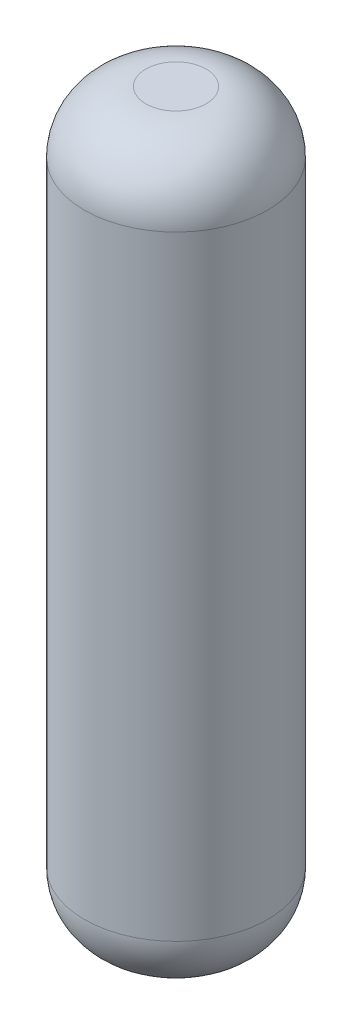
ISO-10303-21;
HEADER;
FILE_DESCRIPTION(('STEP AP214'),'2;1');
FILE_NAME('part.step','',(''),(''),'','','');
FILE_SCHEMA(('AUTOMOTIVE_DESIGN { 1 0 10303 214 1 1 1 1 }'));
ENDSEC;
DATA;
#1=APPLICATION_CONTEXT('core data for automotive mechanical design processes');
#2=APPLICATION_PROTOCOL_DEFINITION('international standard','automotive_design',2000,#1);
#3=PRODUCT_CONTEXT('',#1,'mechanical');
#4=PRODUCT('Part','Part','',(#3));
#5=PRODUCT_RELATED_PRODUCT_CATEGORY('part','',(#4));
#6=PRODUCT_DEFINITION_FORMATION('','',#4);
#7=PRODUCT_DEFINITION_CONTEXT('part definition',#1,'design');
#8=PRODUCT_DEFINITION('design','',#6,#7);
#9=PRODUCT_DEFINITION_SHAPE('','',#8);
#10=(LENGTH_UNIT() NAMED_UNIT(*) SI_UNIT(.MILLI.,.METRE.));
#11=(NAMED_UNIT(*) PLANE_ANGLE_UNIT() SI_UNIT($,.RADIAN.));
#12=(NAMED_UNIT(*) SI_UNIT($,.STERADIAN.) SOLID_ANGLE_UNIT());
#13=UNCERTAINTY_MEASURE_WITH_UNIT(LENGTH_MEASURE(1.E-05),#10,'distance_accuracy_value','');
#14=(GEOMETRIC_REPRESENTATION_CONTEXT(3) GLOBAL_UNCERTAINTY_ASSIGNED_CONTEXT((#13)) GLOBAL_UNIT_ASSIGNED_CONTEXT((#10,
#11,#12)) REPRESENTATION_CONTEXT('',''));
#15=CARTESIAN_POINT('',(0.,0.,0.));
#16=DIRECTION('',(0.,0.,1.));
#17=DIRECTION('',(1.,0.,0.));
#18=AXIS2_PLACEMENT_3D('',#15,#16,#17);
#19=CARTESIAN_POINT('',(0.,609.6,0.));
#20=DIRECTION('',(0.,-1.,0.));
#21=DIRECTION('',(0.,0.,-1.));
#22=AXIS2_PLACEMENT_3D('',#19,#20,#21);
#23=CYLINDRICAL_SURFACE('',#22,75.7271773514437);
#24=CARTESIAN_POINT('',(0.,50.7999999999995,0.));
#25=DIRECTION('',(0.,1.,0.));
#26=DIRECTION('',(0.,0.,1.));
#27=AXIS2_PLACEMENT_3D('',#24,#25,#26);
#28=CIRCLE('',#27,75.7271773514437);
#29=CARTESIAN_POINT('',(0.,50.7999999999995,75.7271773514437));
#30=VERTEX_POINT('',#29);
#31=EDGE_CURVE('E54',#30,#30,#28,.T.);
#32=ORIENTED_EDGE('',*,*,#31,.T.);
#33=EDGE_LOOP('',(#32));
#34=FACE_BOUND('',#33,.T.);
#35=CARTESIAN_POINT('',(0.,558.8,0.));
#36=DIRECTION('',(0.,1.,0.));
#37=DIRECTION('',(0.,0.,1.));
#38=AXIS2_PLACEMENT_3D('',#35,#36,#37);
#39=CIRCLE('',#38,75.7271773514437);
#40=CARTESIAN_POINT('',(0.,558.8,75.7271773514437));
#41=VERTEX_POINT('',#40);
#42=EDGE_CURVE('E58',#41,#41,#39,.F.);
#43=ORIENTED_EDGE('',*,*,#42,.T.);
#44=EDGE_LOOP('',(#43));
#45=FACE_BOUND('',#44,.T.);
#46=ADVANCED_FACE('F43',(#34,#45),#23,.T.);
#47=CARTESIAN_POINT('',(0.,609.6,0.));
#48=DIRECTION('',(0.,1.,0.));
#49=DIRECTION('',(0.,0.,1.));
#50=AXIS2_PLACEMENT_3D('',#47,#48,#49);
#51=PLANE('',#50);
#52=CARTESIAN_POINT('',(0.,609.6,0.));
#53=DIRECTION('',(0.,1.,0.));
#54=DIRECTION('',(0.,0.,1.));
#55=AXIS2_PLACEMENT_3D('',#52,#53,#54);
#56=CIRCLE('',#55,24.9271773514437);
#57=CARTESIAN_POINT('',(0.,609.6,24.9271773514437));
#58=VERTEX_POINT('',#57);
#59=EDGE_CURVE('E10',#58,#58,#56,.T.);
#60=ORIENTED_EDGE('',*,*,#59,.T.);
#61=EDGE_LOOP('',(#60));
#62=FACE_BOUND('',#61,.T.);
#63=ADVANCED_FACE('F74',(#62),#51,.T.);
#64=CARTESIAN_POINT('',(0.,0.,0.));
#65=DIRECTION('',(0.,1.,0.));
#66=DIRECTION('',(0.,0.,1.));
#67=AXIS2_PLACEMENT_3D('',#64,#65,#66);
#68=PLANE('',#67);
#69=CARTESIAN_POINT('',(0.,0.,0.));
#70=DIRECTION('',(0.,1.,0.));
#71=DIRECTION('',(0.,0.,1.));
#72=AXIS2_PLACEMENT_3D('',#69,#70,#71);
#73=CIRCLE('',#72,24.9271773514437);
#74=CARTESIAN_POINT('',(0.,0.,24.9271773514437));
#75=VERTEX_POINT('',#74);
#76=EDGE_CURVE('E50',#75,#75,#73,.F.);
#77=ORIENTED_EDGE('',*,*,#76,.T.);
#78=EDGE_LOOP('',(#77));
#79=FACE_BOUND('',#78,.T.);
#80=ADVANCED_FACE('F71',(#79),#68,.F.);
#81=CARTESIAN_POINT('',(0.,50.8,0.));
#82=DIRECTION('',(0.,1.,0.));
#83=DIRECTION('',(0.,0.,1.));
#84=AXIS2_PLACEMENT_3D('',#81,#82,#83);
#85=DEGENERATE_TOROIDAL_SURFACE('',#84,24.9271773514437,50.8,.T.);
#86=ORIENTED_EDGE('',*,*,#76,.F.);
#87=EDGE_LOOP('',(#86));
#88=FACE_BOUND('',#87,.T.);
#89=ORIENTED_EDGE('',*,*,#31,.F.);
#90=EDGE_LOOP('',(#89));
#91=FACE_BOUND('',#90,.T.);
#92=ADVANCED_FACE('F67',(#88,#91),#85,.T.);
#93=CARTESIAN_POINT('',(0.,558.8,0.));
#94=DIRECTION('',(0.,1.,0.));
#95=DIRECTION('',(0.,0.,1.));
#96=AXIS2_PLACEMENT_3D('',#93,#94,#95);
#97=DEGENERATE_TOROIDAL_SURFACE('',#96,24.9271773514437,50.8,.T.);
#98=ORIENTED_EDGE('',*,*,#42,.F.);
#99=EDGE_LOOP('',(#98));
#100=FACE_BOUND('',#99,.T.);
#101=ORIENTED_EDGE('',*,*,#59,.F.);
#102=EDGE_LOOP('',(#101));
#103=FACE_BOUND('',#102,.T.);
#104=ADVANCED_FACE('F45',(#100,#103),#97,.T.);
#105=CLOSED_SHELL('',(#46,#63,#80,#92,#104));
#106=MANIFOLD_SOLID_BREP('B2',#105);
#107=ADVANCED_BREP_SHAPE_REPRESENTATION('',(#18,#106),#14);
#108=SHAPE_DEFINITION_REPRESENTATION(#9,#107);
ENDSEC;
END-ISO-10303-21;
